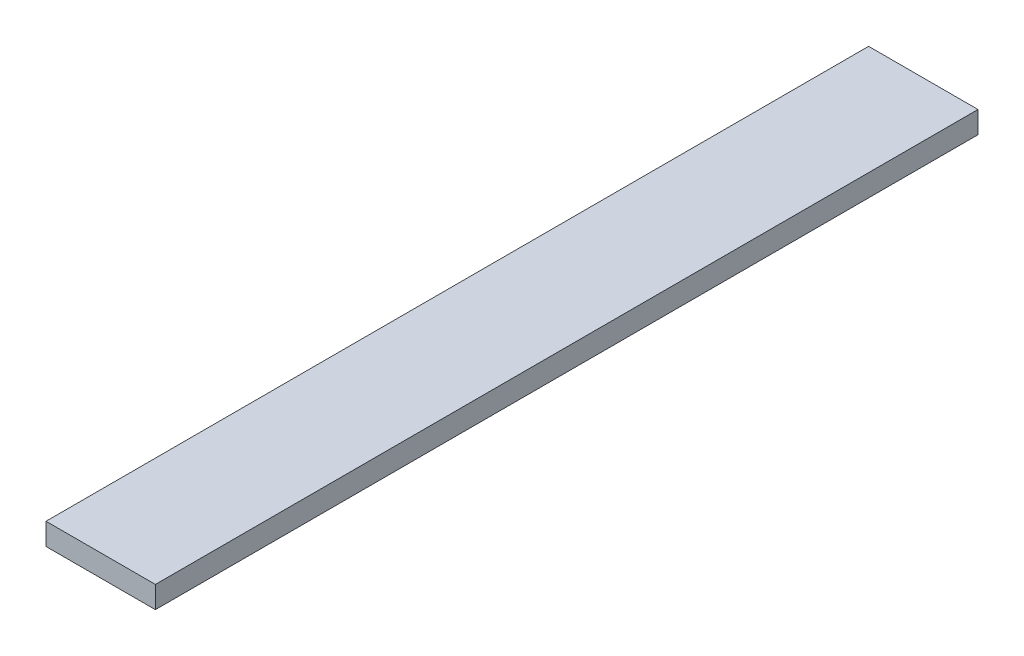
ISO-10303-21;
HEADER;
FILE_DESCRIPTION(('STEP AP214'),'2;1');
FILE_NAME('part.step','',(''),(''),'','','');
FILE_SCHEMA(('AUTOMOTIVE_DESIGN { 1 0 10303 214 1 1 1 1 }'));
ENDSEC;
DATA;
#1=APPLICATION_CONTEXT('core data for automotive mechanical design processes');
#2=APPLICATION_PROTOCOL_DEFINITION('international standard','automotive_design',2000,#1);
#3=PRODUCT_CONTEXT('',#1,'mechanical');
#4=PRODUCT('Part','Part','',(#3));
#5=PRODUCT_RELATED_PRODUCT_CATEGORY('part','',(#4));
#6=PRODUCT_DEFINITION_FORMATION('','',#4);
#7=PRODUCT_DEFINITION_CONTEXT('part definition',#1,'design');
#8=PRODUCT_DEFINITION('design','',#6,#7);
#9=PRODUCT_DEFINITION_SHAPE('','',#8);
#10=(LENGTH_UNIT() NAMED_UNIT(*) SI_UNIT(.MILLI.,.METRE.));
#11=(NAMED_UNIT(*) PLANE_ANGLE_UNIT() SI_UNIT($,.RADIAN.));
#12=(NAMED_UNIT(*) SI_UNIT($,.STERADIAN.) SOLID_ANGLE_UNIT());
#13=UNCERTAINTY_MEASURE_WITH_UNIT(LENGTH_MEASURE(1.E-05),#10,'distance_accuracy_value','');
#14=(GEOMETRIC_REPRESENTATION_CONTEXT(3) GLOBAL_UNCERTAINTY_ASSIGNED_CONTEXT((#13)) GLOBAL_UNIT_ASSIGNED_CONTEXT((#10,
#11,#12)) REPRESENTATION_CONTEXT('',''));
#15=CARTESIAN_POINT('',(0.,0.,0.));
#16=DIRECTION('',(0.,0.,1.));
#17=DIRECTION('',(1.,0.,0.));
#18=AXIS2_PLACEMENT_3D('',#15,#16,#17);
#19=CARTESIAN_POINT('',(0.,2.02999999999,0.));
#20=DIRECTION('',(0.,1.,0.));
#21=DIRECTION('',(0.,0.,1.));
#22=AXIS2_PLACEMENT_3D('',#19,#20,#21);
#23=PLANE('',#22);
#24=DIRECTION('',(1.,0.,0.));
#25=VECTOR('',#24,1.);
#26=CARTESIAN_POINT('',(0.,2.02999999999,0.195));
#27=LINE('',#26,#25);
#28=CARTESIAN_POINT('',(-1.625,2.02999999999,0.195));
#29=VERTEX_POINT('',#28);
#30=CARTESIAN_POINT('',(-1.875,2.02999999999,0.195));
#31=VERTEX_POINT('',#30);
#32=EDGE_CURVE('E19',#29,#31,#27,.F.);
#33=ORIENTED_EDGE('',*,*,#32,.F.);
#34=DIRECTION('',(0.,0.,1.));
#35=VECTOR('',#34,1.);
#36=CARTESIAN_POINT('',(-1.625,2.02999999999,0.195));
#37=LINE('',#36,#35);
#38=CARTESIAN_POINT('',(-1.625,2.02999999999,2.075));
#39=VERTEX_POINT('',#38);
#40=EDGE_CURVE('E68',#29,#39,#37,.T.);
#41=ORIENTED_EDGE('',*,*,#40,.T.);
#42=DIRECTION('',(-1.,0.,0.));
#43=VECTOR('',#42,1.);
#44=CARTESIAN_POINT('',(-1.875,2.02999999999,2.075));
#45=LINE('',#44,#43);
#46=CARTESIAN_POINT('',(-1.875,2.02999999999,2.075));
#47=VERTEX_POINT('',#46);
#48=EDGE_CURVE('E55',#39,#47,#45,.T.);
#49=ORIENTED_EDGE('',*,*,#48,.T.);
#50=DIRECTION('',(0.,0.,1.));
#51=VECTOR('',#50,1.);
#52=CARTESIAN_POINT('',(-1.875,2.02999999999,0.195));
#53=LINE('',#52,#51);
#54=EDGE_CURVE('E61',#47,#31,#53,.F.);
#55=ORIENTED_EDGE('',*,*,#54,.T.);
#56=EDGE_LOOP('',(#33,#41,#49,#55));
#57=FACE_BOUND('',#56,.T.);
#58=ADVANCED_FACE('F16',(#57),#23,.F.);
#59=CARTESIAN_POINT('',(-1.875,2.07999999999,0.195));
#60=DIRECTION('',(1.,0.,0.));
#61=DIRECTION('',(0.,1.,0.));
#62=AXIS2_PLACEMENT_3D('',#59,#60,#61);
#63=PLANE('',#62);
#64=DIRECTION('',(0.,1.,0.));
#65=VECTOR('',#64,1.);
#66=CARTESIAN_POINT('',(-1.875,2.07999999999,2.075));
#67=LINE('',#66,#65);
#68=CARTESIAN_POINT('',(-1.875,2.07999999999,2.075));
#69=VERTEX_POINT('',#68);
#70=EDGE_CURVE('E63',#47,#69,#67,.T.);
#71=ORIENTED_EDGE('',*,*,#70,.T.);
#72=DIRECTION('',(0.,0.,1.));
#73=VECTOR('',#72,1.);
#74=CARTESIAN_POINT('',(-1.875,2.07999999999,0.));
#75=LINE('',#74,#73);
#76=CARTESIAN_POINT('',(-1.875,2.07999999999,0.195));
#77=VERTEX_POINT('',#76);
#78=EDGE_CURVE('E82',#77,#69,#75,.T.);
#79=ORIENTED_EDGE('',*,*,#78,.F.);
#80=DIRECTION('',(0.,1.,0.));
#81=VECTOR('',#80,1.);
#82=CARTESIAN_POINT('',(-1.875,2.07999999999,0.195));
#83=LINE('',#82,#81);
#84=EDGE_CURVE('E66',#77,#31,#83,.F.);
#85=ORIENTED_EDGE('',*,*,#84,.T.);
#86=ORIENTED_EDGE('',*,*,#54,.F.);
#87=EDGE_LOOP('',(#71,#79,#85,#86));
#88=FACE_BOUND('',#87,.T.);
#89=ADVANCED_FACE('F62',(#88),#63,.F.);
#90=CARTESIAN_POINT('',(-1.875,2.07999999999,2.075));
#91=DIRECTION('',(0.,0.,-1.));
#92=DIRECTION('',(-1.,0.,0.));
#93=AXIS2_PLACEMENT_3D('',#90,#91,#92);
#94=PLANE('',#93);
#95=DIRECTION('',(0.,-1.,0.));
#96=VECTOR('',#95,1.);
#97=CARTESIAN_POINT('',(-1.625,2.07999999999,2.075));
#98=LINE('',#97,#96);
#99=CARTESIAN_POINT('',(-1.625,2.07999999999,2.075));
#100=VERTEX_POINT('',#99);
#101=EDGE_CURVE('E70',#39,#100,#98,.F.);
#102=ORIENTED_EDGE('',*,*,#101,.T.);
#103=DIRECTION('',(1.,0.,0.));
#104=VECTOR('',#103,1.);
#105=CARTESIAN_POINT('',(0.,2.07999999999,2.075));
#106=LINE('',#105,#104);
#107=EDGE_CURVE('E74',#69,#100,#106,.T.);
#108=ORIENTED_EDGE('',*,*,#107,.F.);
#109=ORIENTED_EDGE('',*,*,#70,.F.);
#110=ORIENTED_EDGE('',*,*,#48,.F.);
#111=EDGE_LOOP('',(#102,#108,#109,#110));
#112=FACE_BOUND('',#111,.T.);
#113=ADVANCED_FACE('F72',(#112),#94,.F.);
#114=CARTESIAN_POINT('',(-1.625,2.07999999999,0.195));
#115=DIRECTION('',(-1.,0.,0.));
#116=DIRECTION('',(0.,-1.,0.));
#117=AXIS2_PLACEMENT_3D('',#114,#115,#116);
#118=PLANE('',#117);
#119=DIRECTION('',(0.,1.,0.));
#120=VECTOR('',#119,1.);
#121=CARTESIAN_POINT('',(-1.625,2.07999999999,0.195));
#122=LINE('',#121,#120);
#123=CARTESIAN_POINT('',(-1.625,2.07999999999,0.195));
#124=VERTEX_POINT('',#123);
#125=EDGE_CURVE('E34',#29,#124,#122,.T.);
#126=ORIENTED_EDGE('',*,*,#125,.T.);
#127=DIRECTION('',(0.,0.,1.));
#128=VECTOR('',#127,1.);
#129=CARTESIAN_POINT('',(-1.625,2.07999999999,0.));
#130=LINE('',#129,#128);
#131=EDGE_CURVE('E25',#100,#124,#130,.F.);
#132=ORIENTED_EDGE('',*,*,#131,.F.);
#133=ORIENTED_EDGE('',*,*,#101,.F.);
#134=ORIENTED_EDGE('',*,*,#40,.F.);
#135=EDGE_LOOP('',(#126,#132,#133,#134));
#136=FACE_BOUND('',#135,.T.);
#137=ADVANCED_FACE('F88',(#136),#118,.F.);
#138=CARTESIAN_POINT('',(-1.875,2.07999999999,0.195));
#139=DIRECTION('',(0.,0.,1.));
#140=DIRECTION('',(1.,0.,0.));
#141=AXIS2_PLACEMENT_3D('',#138,#139,#140);
#142=PLANE('',#141);
#143=ORIENTED_EDGE('',*,*,#84,.F.);
#144=DIRECTION('',(1.,0.,0.));
#145=VECTOR('',#144,1.);
#146=CARTESIAN_POINT('',(0.,2.07999999999,0.195));
#147=LINE('',#146,#145);
#148=EDGE_CURVE('E11',#124,#77,#147,.F.);
#149=ORIENTED_EDGE('',*,*,#148,.F.);
#150=ORIENTED_EDGE('',*,*,#125,.F.);
#151=ORIENTED_EDGE('',*,*,#32,.T.);
#152=EDGE_LOOP('',(#143,#149,#150,#151));
#153=FACE_BOUND('',#152,.T.);
#154=ADVANCED_FACE('F90',(#153),#142,.F.);
#155=CARTESIAN_POINT('',(0.,2.07999999999,0.));
#156=DIRECTION('',(0.,1.,0.));
#157=DIRECTION('',(0.,0.,1.));
#158=AXIS2_PLACEMENT_3D('',#155,#156,#157);
#159=PLANE('',#158);
#160=ORIENTED_EDGE('',*,*,#131,.T.);
#161=ORIENTED_EDGE('',*,*,#148,.T.);
#162=ORIENTED_EDGE('',*,*,#78,.T.);
#163=ORIENTED_EDGE('',*,*,#107,.T.);
#164=EDGE_LOOP('',(#160,#161,#162,#163));
#165=FACE_BOUND('',#164,.T.);
#166=ADVANCED_FACE('F87',(#165),#159,.T.);
#167=CLOSED_SHELL('',(#58,#89,#113,#137,#154,#166));
#168=MANIFOLD_SOLID_BREP('B1',#167);
#169=ADVANCED_BREP_SHAPE_REPRESENTATION('',(#18,#168),#14);
#170=SHAPE_DEFINITION_REPRESENTATION(#9,#169);
ENDSEC;
END-ISO-10303-21;
